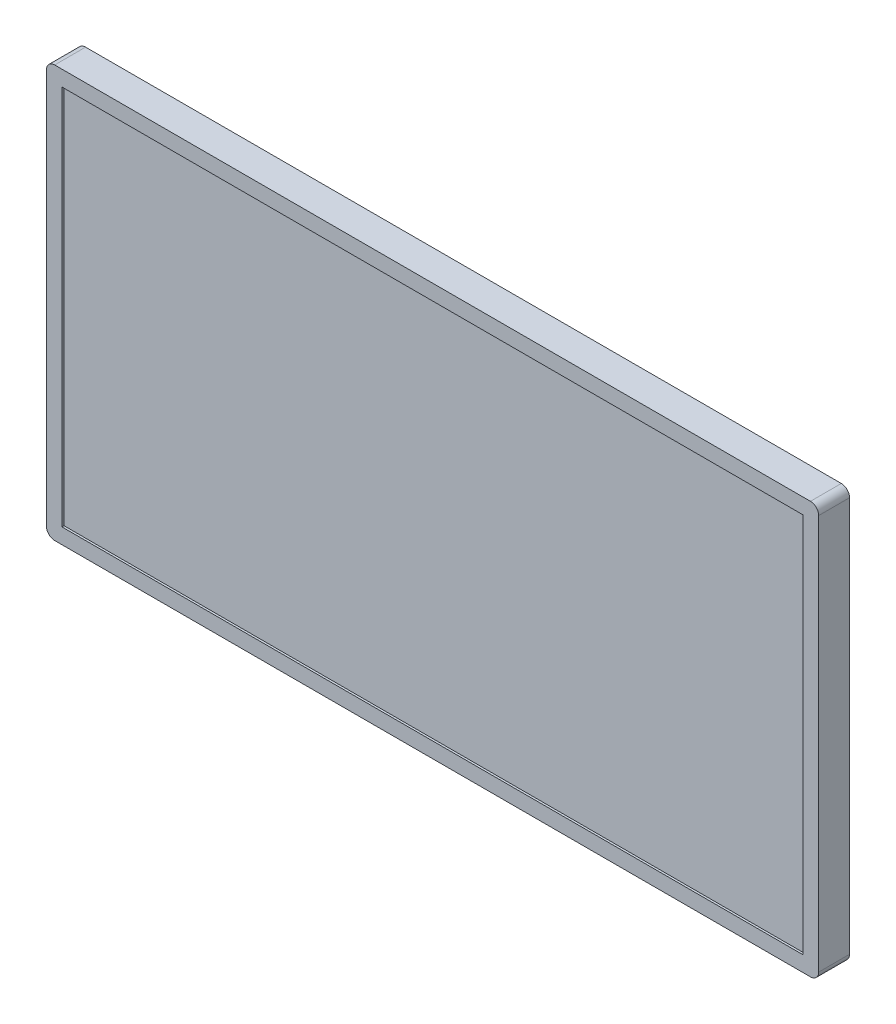
ISO-10303-21;
HEADER;
FILE_DESCRIPTION(('STEP AP214'),'2;1');
FILE_NAME('part.step','',(''),(''),'','','');
FILE_SCHEMA(('AUTOMOTIVE_DESIGN { 1 0 10303 214 1 1 1 1 }'));
ENDSEC;
DATA;
#1=APPLICATION_CONTEXT('core data for automotive mechanical design processes');
#2=APPLICATION_PROTOCOL_DEFINITION('international standard','automotive_design',2000,#1);
#3=PRODUCT_CONTEXT('',#1,'mechanical');
#4=PRODUCT('Part','Part','',(#3));
#5=PRODUCT_RELATED_PRODUCT_CATEGORY('part','',(#4));
#6=PRODUCT_DEFINITION_FORMATION('','',#4);
#7=PRODUCT_DEFINITION_CONTEXT('part definition',#1,'design');
#8=PRODUCT_DEFINITION('design','',#6,#7);
#9=PRODUCT_DEFINITION_SHAPE('','',#8);
#10=(LENGTH_UNIT() NAMED_UNIT(*) SI_UNIT(.MILLI.,.METRE.));
#11=(NAMED_UNIT(*) PLANE_ANGLE_UNIT() SI_UNIT($,.RADIAN.));
#12=(NAMED_UNIT(*) SI_UNIT($,.STERADIAN.) SOLID_ANGLE_UNIT());
#13=UNCERTAINTY_MEASURE_WITH_UNIT(LENGTH_MEASURE(1.E-05),#10,'distance_accuracy_value','');
#14=(GEOMETRIC_REPRESENTATION_CONTEXT(3) GLOBAL_UNCERTAINTY_ASSIGNED_CONTEXT((#13)) GLOBAL_UNIT_ASSIGNED_CONTEXT((#10,
#11,#12)) REPRESENTATION_CONTEXT('',''));
#15=CARTESIAN_POINT('',(0.,0.,0.));
#16=DIRECTION('',(0.,0.,1.));
#17=DIRECTION('',(1.,0.,0.));
#18=AXIS2_PLACEMENT_3D('',#15,#16,#17);
#19=CARTESIAN_POINT('',(0.,0.,30.));
#20=DIRECTION('',(1.,0.,0.));
#21=DIRECTION('',(0.,1.,0.));
#22=AXIS2_PLACEMENT_3D('',#19,#20,#21);
#23=PLANE('',#22);
#24=DIRECTION('',(0.,-1.,0.));
#25=VECTOR('',#24,1.);
#26=CARTESIAN_POINT('',(0.,0.,0.));
#27=LINE('',#26,#25);
#28=CARTESIAN_POINT('',(0.,392.,0.));
#29=VERTEX_POINT('',#28);
#30=CARTESIAN_POINT('',(0.,8.,0.));
#31=VERTEX_POINT('',#30);
#32=EDGE_CURVE('E164',#29,#31,#27,.T.);
#33=ORIENTED_EDGE('',*,*,#32,.T.);
#34=DIRECTION('',(0.,0.,-1.));
#35=VECTOR('',#34,1.);
#36=CARTESIAN_POINT('',(0.,8.,30.));
#37=LINE('',#36,#35);
#38=CARTESIAN_POINT('',(0.,8.,30.));
#39=VERTEX_POINT('',#38);
#40=EDGE_CURVE('E204',#31,#39,#37,.F.);
#41=ORIENTED_EDGE('',*,*,#40,.T.);
#42=DIRECTION('',(0.,-1.,0.));
#43=VECTOR('',#42,1.);
#44=CARTESIAN_POINT('',(0.,0.,30.));
#45=LINE('',#44,#43);
#46=CARTESIAN_POINT('',(0.,392.,30.));
#47=VERTEX_POINT('',#46);
#48=EDGE_CURVE('E168',#47,#39,#45,.T.);
#49=ORIENTED_EDGE('',*,*,#48,.F.);
#50=DIRECTION('',(0.,0.,-1.));
#51=VECTOR('',#50,1.);
#52=CARTESIAN_POINT('',(0.,392.,30.));
#53=LINE('',#52,#51);
#54=EDGE_CURVE('E201',#47,#29,#53,.T.);
#55=ORIENTED_EDGE('',*,*,#54,.T.);
#56=EDGE_LOOP('',(#33,#41,#49,#55));
#57=FACE_BOUND('',#56,.T.);
#58=ADVANCED_FACE('F35',(#57),#23,.F.);
#59=CARTESIAN_POINT('',(0.,0.,30.));
#60=DIRECTION('',(0.,1.,0.));
#61=DIRECTION('',(0.,0.,1.));
#62=AXIS2_PLACEMENT_3D('',#59,#60,#61);
#63=PLANE('',#62);
#64=DIRECTION('',(1.,0.,0.));
#65=VECTOR('',#64,1.);
#66=CARTESIAN_POINT('',(0.,0.,30.));
#67=LINE('',#66,#65);
#68=CARTESIAN_POINT('',(8.,0.,30.));
#69=VERTEX_POINT('',#68);
#70=CARTESIAN_POINT('',(742.,0.,30.));
#71=VERTEX_POINT('',#70);
#72=EDGE_CURVE('E171',#69,#71,#67,.T.);
#73=ORIENTED_EDGE('',*,*,#72,.F.);
#74=DIRECTION('',(0.,0.,-1.));
#75=VECTOR('',#74,1.);
#76=CARTESIAN_POINT('',(8.,0.,30.));
#77=LINE('',#76,#75);
#78=CARTESIAN_POINT('',(8.,0.,0.));
#79=VERTEX_POINT('',#78);
#80=EDGE_CURVE('E190',#69,#79,#77,.T.);
#81=ORIENTED_EDGE('',*,*,#80,.T.);
#82=DIRECTION('',(1.,0.,0.));
#83=VECTOR('',#82,1.);
#84=CARTESIAN_POINT('',(0.,0.,0.));
#85=LINE('',#84,#83);
#86=CARTESIAN_POINT('',(742.,0.,0.));
#87=VERTEX_POINT('',#86);
#88=EDGE_CURVE('E182',#79,#87,#85,.T.);
#89=ORIENTED_EDGE('',*,*,#88,.T.);
#90=DIRECTION('',(0.,0.,-1.));
#91=VECTOR('',#90,1.);
#92=CARTESIAN_POINT('',(742.,0.,30.));
#93=LINE('',#92,#91);
#94=EDGE_CURVE('E179',#87,#71,#93,.F.);
#95=ORIENTED_EDGE('',*,*,#94,.T.);
#96=EDGE_LOOP('',(#73,#81,#89,#95));
#97=FACE_BOUND('',#96,.T.);
#98=ADVANCED_FACE('F247',(#97),#63,.F.);
#99=CARTESIAN_POINT('',(750.,0.,30.));
#100=DIRECTION('',(-1.,0.,0.));
#101=DIRECTION('',(0.,0.,1.));
#102=AXIS2_PLACEMENT_3D('',#99,#100,#101);
#103=PLANE('',#102);
#104=DIRECTION('',(0.,1.,0.));
#105=VECTOR('',#104,1.);
#106=CARTESIAN_POINT('',(750.,0.,30.));
#107=LINE('',#106,#105);
#108=CARTESIAN_POINT('',(750.,8.,30.));
#109=VERTEX_POINT('',#108);
#110=CARTESIAN_POINT('',(750.,392.,30.));
#111=VERTEX_POINT('',#110);
#112=EDGE_CURVE('E175',#109,#111,#107,.T.);
#113=ORIENTED_EDGE('',*,*,#112,.F.);
#114=DIRECTION('',(0.,0.,-1.));
#115=VECTOR('',#114,1.);
#116=CARTESIAN_POINT('',(750.,8.,30.));
#117=LINE('',#116,#115);
#118=CARTESIAN_POINT('',(750.,8.,0.));
#119=VERTEX_POINT('',#118);
#120=EDGE_CURVE('E215',#109,#119,#117,.T.);
#121=ORIENTED_EDGE('',*,*,#120,.T.);
#122=DIRECTION('',(0.,1.,0.));
#123=VECTOR('',#122,1.);
#124=CARTESIAN_POINT('',(750.,0.,0.));
#125=LINE('',#124,#123);
#126=CARTESIAN_POINT('',(750.,392.,0.));
#127=VERTEX_POINT('',#126);
#128=EDGE_CURVE('E185',#119,#127,#125,.T.);
#129=ORIENTED_EDGE('',*,*,#128,.T.);
#130=DIRECTION('',(0.,0.,-1.));
#131=VECTOR('',#130,1.);
#132=CARTESIAN_POINT('',(750.,392.,30.));
#133=LINE('',#132,#131);
#134=EDGE_CURVE('E213',#127,#111,#133,.F.);
#135=ORIENTED_EDGE('',*,*,#134,.T.);
#136=EDGE_LOOP('',(#113,#121,#129,#135));
#137=FACE_BOUND('',#136,.T.);
#138=ADVANCED_FACE('F221',(#137),#103,.F.);
#139=CARTESIAN_POINT('',(0.,400.,30.));
#140=DIRECTION('',(0.,-1.,0.));
#141=DIRECTION('',(1.,0.,0.));
#142=AXIS2_PLACEMENT_3D('',#139,#140,#141);
#143=PLANE('',#142);
#144=DIRECTION('',(-1.,0.,0.));
#145=VECTOR('',#144,1.);
#146=CARTESIAN_POINT('',(0.,400.,30.));
#147=LINE('',#146,#145);
#148=CARTESIAN_POINT('',(742.,400.,30.));
#149=VERTEX_POINT('',#148);
#150=CARTESIAN_POINT('',(8.00000000000002,400.,30.));
#151=VERTEX_POINT('',#150);
#152=EDGE_CURVE('E177',#149,#151,#147,.T.);
#153=ORIENTED_EDGE('',*,*,#152,.F.);
#154=DIRECTION('',(0.,0.,-1.));
#155=VECTOR('',#154,1.);
#156=CARTESIAN_POINT('',(742.,400.,30.));
#157=LINE('',#156,#155);
#158=CARTESIAN_POINT('',(742.,400.,0.));
#159=VERTEX_POINT('',#158);
#160=EDGE_CURVE('E11',#149,#159,#157,.T.);
#161=ORIENTED_EDGE('',*,*,#160,.T.);
#162=DIRECTION('',(-1.,0.,0.));
#163=VECTOR('',#162,1.);
#164=CARTESIAN_POINT('',(0.,400.,0.));
#165=LINE('',#164,#163);
#166=CARTESIAN_POINT('',(8.00000000000002,400.,0.));
#167=VERTEX_POINT('',#166);
#168=EDGE_CURVE('E172',#159,#167,#165,.T.);
#169=ORIENTED_EDGE('',*,*,#168,.T.);
#170=DIRECTION('',(0.,0.,-1.));
#171=VECTOR('',#170,1.);
#172=CARTESIAN_POINT('',(8.00000000000002,400.,30.));
#173=LINE('',#172,#171);
#174=EDGE_CURVE('E43',#167,#151,#173,.F.);
#175=ORIENTED_EDGE('',*,*,#174,.T.);
#176=EDGE_LOOP('',(#153,#161,#169,#175));
#177=FACE_BOUND('',#176,.T.);
#178=ADVANCED_FACE('F232',(#177),#143,.F.);
#179=CARTESIAN_POINT('',(0.,0.,30.));
#180=DIRECTION('',(0.,0.,-1.));
#181=DIRECTION('',(-1.,0.,0.));
#182=AXIS2_PLACEMENT_3D('',#179,#180,#181);
#183=PLANE('',#182);
#184=DIRECTION('',(1.,0.,0.));
#185=VECTOR('',#184,1.);
#186=CARTESIAN_POINT('',(735.,15.0000000000001,30.));
#187=LINE('',#186,#185);
#188=CARTESIAN_POINT('',(15.0000000000001,15.,30.));
#189=VERTEX_POINT('',#188);
#190=CARTESIAN_POINT('',(735.,15.0000000000001,30.));
#191=VERTEX_POINT('',#190);
#192=EDGE_CURVE('E158',#189,#191,#187,.T.);
#193=ORIENTED_EDGE('',*,*,#192,.F.);
#194=DIRECTION('',(0.,-1.,0.));
#195=VECTOR('',#194,1.);
#196=CARTESIAN_POINT('',(15.0000000000001,15.,30.));
#197=LINE('',#196,#195);
#198=CARTESIAN_POINT('',(15.,385.,30.));
#199=VERTEX_POINT('',#198);
#200=EDGE_CURVE('E132',#199,#189,#197,.T.);
#201=ORIENTED_EDGE('',*,*,#200,.F.);
#202=DIRECTION('',(-1.,0.,0.));
#203=VECTOR('',#202,1.);
#204=CARTESIAN_POINT('',(735.,385.,30.));
#205=LINE('',#204,#203);
#206=CARTESIAN_POINT('',(735.,385.,30.));
#207=VERTEX_POINT('',#206);
#208=EDGE_CURVE('E149',#207,#199,#205,.T.);
#209=ORIENTED_EDGE('',*,*,#208,.F.);
#210=DIRECTION('',(0.,1.,0.));
#211=VECTOR('',#210,1.);
#212=CARTESIAN_POINT('',(735.,15.0000000000001,30.));
#213=LINE('',#212,#211);
#214=EDGE_CURVE('E152',#191,#207,#213,.T.);
#215=ORIENTED_EDGE('',*,*,#214,.F.);
#216=EDGE_LOOP('',(#193,#201,#209,#215));
#217=FACE_BOUND('',#216,.T.);
#218=ORIENTED_EDGE('',*,*,#48,.T.);
#219=CARTESIAN_POINT('',(8.,8.,30.));
#220=DIRECTION('',(0.,0.,-1.));
#221=DIRECTION('',(-1.,0.,0.));
#222=AXIS2_PLACEMENT_3D('',#219,#220,#221);
#223=CIRCLE('',#222,8.);
#224=EDGE_CURVE('E211',#39,#69,#223,.F.);
#225=ORIENTED_EDGE('',*,*,#224,.T.);
#226=ORIENTED_EDGE('',*,*,#72,.T.);
#227=CARTESIAN_POINT('',(742.,8.,30.));
#228=DIRECTION('',(0.,0.,-1.));
#229=DIRECTION('',(-1.,0.,0.));
#230=AXIS2_PLACEMENT_3D('',#227,#228,#229);
#231=CIRCLE('',#230,8.);
#232=EDGE_CURVE('E209',#71,#109,#231,.F.);
#233=ORIENTED_EDGE('',*,*,#232,.T.);
#234=ORIENTED_EDGE('',*,*,#112,.T.);
#235=CARTESIAN_POINT('',(742.,392.,30.));
#236=DIRECTION('',(0.,0.,-1.));
#237=DIRECTION('',(-1.,0.,0.));
#238=AXIS2_PLACEMENT_3D('',#235,#236,#237);
#239=CIRCLE('',#238,8.);
#240=EDGE_CURVE('E56',#111,#149,#239,.F.);
#241=ORIENTED_EDGE('',*,*,#240,.T.);
#242=ORIENTED_EDGE('',*,*,#152,.T.);
#243=CARTESIAN_POINT('',(8.00000000000002,392.,30.));
#244=DIRECTION('',(0.,0.,-1.));
#245=DIRECTION('',(-1.,0.,0.));
#246=AXIS2_PLACEMENT_3D('',#243,#244,#245);
#247=CIRCLE('',#246,8.);
#248=EDGE_CURVE('E206',#151,#47,#247,.F.);
#249=ORIENTED_EDGE('',*,*,#248,.T.);
#250=EDGE_LOOP('',(#218,#225,#226,#233,#234,#241,#242,#249));
#251=FACE_BOUND('',#250,.T.);
#252=ADVANCED_FACE('F234',(#217,#251),#183,.F.);
#253=CARTESIAN_POINT('',(0.,0.,0.));
#254=DIRECTION('',(0.,0.,-1.));
#255=DIRECTION('',(-1.,0.,0.));
#256=AXIS2_PLACEMENT_3D('',#253,#254,#255);
#257=PLANE('',#256);
#258=ORIENTED_EDGE('',*,*,#88,.F.);
#259=CARTESIAN_POINT('',(8.,8.,0.));
#260=DIRECTION('',(0.,0.,-1.));
#261=DIRECTION('',(-1.,0.,0.));
#262=AXIS2_PLACEMENT_3D('',#259,#260,#261);
#263=CIRCLE('',#262,8.);
#264=EDGE_CURVE('E199',#79,#31,#263,.T.);
#265=ORIENTED_EDGE('',*,*,#264,.T.);
#266=ORIENTED_EDGE('',*,*,#32,.F.);
#267=CARTESIAN_POINT('',(8.00000000000002,392.,0.));
#268=DIRECTION('',(0.,0.,-1.));
#269=DIRECTION('',(-1.,0.,0.));
#270=AXIS2_PLACEMENT_3D('',#267,#268,#269);
#271=CIRCLE('',#270,8.);
#272=EDGE_CURVE('E193',#29,#167,#271,.T.);
#273=ORIENTED_EDGE('',*,*,#272,.T.);
#274=ORIENTED_EDGE('',*,*,#168,.F.);
#275=CARTESIAN_POINT('',(742.,392.,0.));
#276=DIRECTION('',(0.,0.,-1.));
#277=DIRECTION('',(-1.,0.,0.));
#278=AXIS2_PLACEMENT_3D('',#275,#276,#277);
#279=CIRCLE('',#278,8.);
#280=EDGE_CURVE('E195',#159,#127,#279,.T.);
#281=ORIENTED_EDGE('',*,*,#280,.T.);
#282=ORIENTED_EDGE('',*,*,#128,.F.);
#283=CARTESIAN_POINT('',(742.,8.,0.));
#284=DIRECTION('',(0.,0.,-1.));
#285=DIRECTION('',(-1.,0.,0.));
#286=AXIS2_PLACEMENT_3D('',#283,#284,#285);
#287=CIRCLE('',#286,8.);
#288=EDGE_CURVE('E197',#119,#87,#287,.T.);
#289=ORIENTED_EDGE('',*,*,#288,.T.);
#290=EDGE_LOOP('',(#258,#265,#266,#273,#274,#281,#282,#289));
#291=FACE_BOUND('',#290,.T.);
#292=ADVANCED_FACE('F227',(#291),#257,.T.);
#293=CARTESIAN_POINT('',(15.0000000000001,15.,28.));
#294=DIRECTION('',(-1.,0.,0.));
#295=DIRECTION('',(0.,-1.,0.));
#296=AXIS2_PLACEMENT_3D('',#293,#294,#295);
#297=PLANE('',#296);
#298=ORIENTED_EDGE('',*,*,#200,.T.);
#299=DIRECTION('',(0.,0.,1.));
#300=VECTOR('',#299,1.);
#301=CARTESIAN_POINT('',(15.0000000000001,15.,28.));
#302=LINE('',#301,#300);
#303=CARTESIAN_POINT('',(15.0000000000001,15.,28.));
#304=VERTEX_POINT('',#303);
#305=EDGE_CURVE('E125',#304,#189,#302,.T.);
#306=ORIENTED_EDGE('',*,*,#305,.F.);
#307=DIRECTION('',(0.,-1.,0.));
#308=VECTOR('',#307,1.);
#309=CARTESIAN_POINT('',(15.0000000000001,15.,28.));
#310=LINE('',#309,#308);
#311=CARTESIAN_POINT('',(15.,385.,28.));
#312=VERTEX_POINT('',#311);
#313=EDGE_CURVE('E129',#312,#304,#310,.T.);
#314=ORIENTED_EDGE('',*,*,#313,.F.);
#315=DIRECTION('',(0.,0.,1.));
#316=VECTOR('',#315,1.);
#317=CARTESIAN_POINT('',(15.,385.,28.));
#318=LINE('',#317,#316);
#319=EDGE_CURVE('E162',#312,#199,#318,.T.);
#320=ORIENTED_EDGE('',*,*,#319,.T.);
#321=EDGE_LOOP('',(#298,#306,#314,#320));
#322=FACE_BOUND('',#321,.T.);
#323=ADVANCED_FACE('F127',(#322),#297,.F.);
#324=CARTESIAN_POINT('',(735.,385.,28.));
#325=DIRECTION('',(0.,1.,0.));
#326=DIRECTION('',(0.,0.,1.));
#327=AXIS2_PLACEMENT_3D('',#324,#325,#326);
#328=PLANE('',#327);
#329=ORIENTED_EDGE('',*,*,#208,.T.);
#330=ORIENTED_EDGE('',*,*,#319,.F.);
#331=DIRECTION('',(-1.,0.,0.));
#332=VECTOR('',#331,1.);
#333=CARTESIAN_POINT('',(735.,385.,28.));
#334=LINE('',#333,#332);
#335=CARTESIAN_POINT('',(735.,385.,28.));
#336=VERTEX_POINT('',#335);
#337=EDGE_CURVE('E137',#336,#312,#334,.T.);
#338=ORIENTED_EDGE('',*,*,#337,.F.);
#339=DIRECTION('',(0.,0.,1.));
#340=VECTOR('',#339,1.);
#341=CARTESIAN_POINT('',(735.,385.,28.));
#342=LINE('',#341,#340);
#343=EDGE_CURVE('E165',#336,#207,#342,.T.);
#344=ORIENTED_EDGE('',*,*,#343,.T.);
#345=EDGE_LOOP('',(#329,#330,#338,#344));
#346=FACE_BOUND('',#345,.T.);
#347=ADVANCED_FACE('F275',(#346),#328,.F.);
#348=CARTESIAN_POINT('',(735.,15.0000000000001,28.));
#349=DIRECTION('',(1.,0.,0.));
#350=DIRECTION('',(0.,0.,-1.));
#351=AXIS2_PLACEMENT_3D('',#348,#349,#350);
#352=PLANE('',#351);
#353=ORIENTED_EDGE('',*,*,#214,.T.);
#354=ORIENTED_EDGE('',*,*,#343,.F.);
#355=DIRECTION('',(0.,1.,0.));
#356=VECTOR('',#355,1.);
#357=CARTESIAN_POINT('',(735.,15.0000000000001,28.));
#358=LINE('',#357,#356);
#359=CARTESIAN_POINT('',(735.,15.0000000000001,28.));
#360=VERTEX_POINT('',#359);
#361=EDGE_CURVE('E145',#360,#336,#358,.T.);
#362=ORIENTED_EDGE('',*,*,#361,.F.);
#363=DIRECTION('',(0.,0.,1.));
#364=VECTOR('',#363,1.);
#365=CARTESIAN_POINT('',(735.,15.0000000000001,28.));
#366=LINE('',#365,#364);
#367=EDGE_CURVE('E136',#360,#191,#366,.T.);
#368=ORIENTED_EDGE('',*,*,#367,.T.);
#369=EDGE_LOOP('',(#353,#354,#362,#368));
#370=FACE_BOUND('',#369,.T.);
#371=ADVANCED_FACE('F278',(#370),#352,.F.);
#372=CARTESIAN_POINT('',(735.,15.0000000000001,28.));
#373=DIRECTION('',(0.,-1.,0.));
#374=DIRECTION('',(1.,0.,0.));
#375=AXIS2_PLACEMENT_3D('',#372,#373,#374);
#376=PLANE('',#375);
#377=ORIENTED_EDGE('',*,*,#192,.T.);
#378=ORIENTED_EDGE('',*,*,#367,.F.);
#379=DIRECTION('',(1.,0.,0.));
#380=VECTOR('',#379,1.);
#381=CARTESIAN_POINT('',(735.,15.0000000000001,28.));
#382=LINE('',#381,#380);
#383=EDGE_CURVE('E140',#304,#360,#382,.T.);
#384=ORIENTED_EDGE('',*,*,#383,.F.);
#385=ORIENTED_EDGE('',*,*,#305,.T.);
#386=EDGE_LOOP('',(#377,#378,#384,#385));
#387=FACE_BOUND('',#386,.T.);
#388=ADVANCED_FACE('F141',(#387),#376,.F.);
#389=CARTESIAN_POINT('',(0.,0.,28.));
#390=DIRECTION('',(0.,0.,1.));
#391=DIRECTION('',(1.,0.,0.));
#392=AXIS2_PLACEMENT_3D('',#389,#390,#391);
#393=PLANE('',#392);
#394=ORIENTED_EDGE('',*,*,#313,.T.);
#395=ORIENTED_EDGE('',*,*,#383,.T.);
#396=ORIENTED_EDGE('',*,*,#361,.T.);
#397=ORIENTED_EDGE('',*,*,#337,.T.);
#398=EDGE_LOOP('',(#394,#395,#396,#397));
#399=FACE_BOUND('',#398,.T.);
#400=ADVANCED_FACE('F147',(#399),#393,.T.);
#401=CARTESIAN_POINT('',(8.,8.,30.));
#402=DIRECTION('',(0.,0.,-1.));
#403=DIRECTION('',(-1.,0.,0.));
#404=AXIS2_PLACEMENT_3D('',#401,#402,#403);
#405=CYLINDRICAL_SURFACE('',#404,8.);
#406=ORIENTED_EDGE('',*,*,#224,.F.);
#407=ORIENTED_EDGE('',*,*,#40,.F.);
#408=ORIENTED_EDGE('',*,*,#264,.F.);
#409=ORIENTED_EDGE('',*,*,#80,.F.);
#410=EDGE_LOOP('',(#406,#407,#408,#409));
#411=FACE_BOUND('',#410,.T.);
#412=ADVANCED_FACE('F244',(#411),#405,.T.);
#413=CARTESIAN_POINT('',(742.,8.,30.));
#414=DIRECTION('',(0.,0.,-1.));
#415=DIRECTION('',(-1.,0.,0.));
#416=AXIS2_PLACEMENT_3D('',#413,#414,#415);
#417=CYLINDRICAL_SURFACE('',#416,8.);
#418=ORIENTED_EDGE('',*,*,#232,.F.);
#419=ORIENTED_EDGE('',*,*,#94,.F.);
#420=ORIENTED_EDGE('',*,*,#288,.F.);
#421=ORIENTED_EDGE('',*,*,#120,.F.);
#422=EDGE_LOOP('',(#418,#419,#420,#421));
#423=FACE_BOUND('',#422,.T.);
#424=ADVANCED_FACE('F249',(#423),#417,.T.);
#425=CARTESIAN_POINT('',(742.,392.,30.));
#426=DIRECTION('',(0.,0.,-1.));
#427=DIRECTION('',(-1.,0.,0.));
#428=AXIS2_PLACEMENT_3D('',#425,#426,#427);
#429=CYLINDRICAL_SURFACE('',#428,8.);
#430=ORIENTED_EDGE('',*,*,#240,.F.);
#431=ORIENTED_EDGE('',*,*,#134,.F.);
#432=ORIENTED_EDGE('',*,*,#280,.F.);
#433=ORIENTED_EDGE('',*,*,#160,.F.);
#434=EDGE_LOOP('',(#430,#431,#432,#433));
#435=FACE_BOUND('',#434,.T.);
#436=ADVANCED_FACE('F231',(#435),#429,.T.);
#437=CARTESIAN_POINT('',(8.00000000000002,392.,30.));
#438=DIRECTION('',(0.,0.,-1.));
#439=DIRECTION('',(-1.,0.,0.));
#440=AXIS2_PLACEMENT_3D('',#437,#438,#439);
#441=CYLINDRICAL_SURFACE('',#440,8.);
#442=ORIENTED_EDGE('',*,*,#248,.F.);
#443=ORIENTED_EDGE('',*,*,#174,.F.);
#444=ORIENTED_EDGE('',*,*,#272,.F.);
#445=ORIENTED_EDGE('',*,*,#54,.F.);
#446=EDGE_LOOP('',(#442,#443,#444,#445));
#447=FACE_BOUND('',#446,.T.);
#448=ADVANCED_FACE('F37',(#447),#441,.T.);
#449=CLOSED_SHELL('',(#58,#98,#138,#178,#252,#292,#323,#347,#371,#388,#400,#412,#424,#436,#448));
#450=MANIFOLD_SOLID_BREP('B2',#449);
#451=ADVANCED_BREP_SHAPE_REPRESENTATION('',(#18,#450),#14);
#452=SHAPE_DEFINITION_REPRESENTATION(#9,#451);
ENDSEC;
END-ISO-10303-21;
